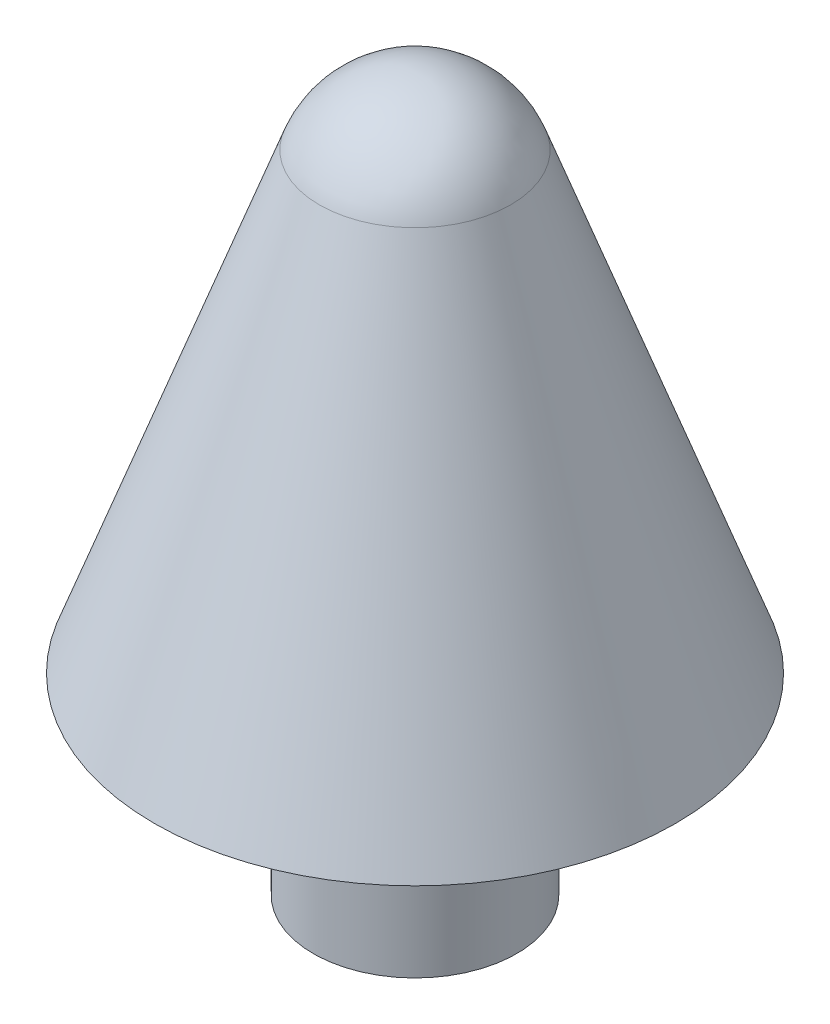
ISO-10303-21;
HEADER;
FILE_DESCRIPTION(('STEP AP214'),'2;1');
FILE_NAME('part.step','',(''),(''),'','','');
FILE_SCHEMA(('AUTOMOTIVE_DESIGN { 1 0 10303 214 1 1 1 1 }'));
ENDSEC;
DATA;
#1=APPLICATION_CONTEXT('core data for automotive mechanical design processes');
#2=APPLICATION_PROTOCOL_DEFINITION('international standard','automotive_design',2000,#1);
#3=PRODUCT_CONTEXT('',#1,'mechanical');
#4=PRODUCT('Part','Part','',(#3));
#5=PRODUCT_RELATED_PRODUCT_CATEGORY('part','',(#4));
#6=PRODUCT_DEFINITION_FORMATION('','',#4);
#7=PRODUCT_DEFINITION_CONTEXT('part definition',#1,'design');
#8=PRODUCT_DEFINITION('design','',#6,#7);
#9=PRODUCT_DEFINITION_SHAPE('','',#8);
#10=(LENGTH_UNIT() NAMED_UNIT(*) SI_UNIT(.MILLI.,.METRE.));
#11=(NAMED_UNIT(*) PLANE_ANGLE_UNIT() SI_UNIT($,.RADIAN.));
#12=(NAMED_UNIT(*) SI_UNIT($,.STERADIAN.) SOLID_ANGLE_UNIT());
#13=UNCERTAINTY_MEASURE_WITH_UNIT(LENGTH_MEASURE(1.E-05),#10,'distance_accuracy_value','');
#14=(GEOMETRIC_REPRESENTATION_CONTEXT(3) GLOBAL_UNCERTAINTY_ASSIGNED_CONTEXT((#13)) GLOBAL_UNIT_ASSIGNED_CONTEXT((#10,
#11,#12)) REPRESENTATION_CONTEXT('',''));
#15=CARTESIAN_POINT('',(0.,0.,0.));
#16=DIRECTION('',(0.,0.,1.));
#17=DIRECTION('',(1.,0.,0.));
#18=AXIS2_PLACEMENT_3D('',#15,#16,#17);
#19=CARTESIAN_POINT('',(0.,0.,0.));
#20=DIRECTION('',(0.,1.,0.));
#21=DIRECTION('',(-1.,0.,0.));
#22=AXIS2_PLACEMENT_3D('',#19,#20,#21);
#23=PLANE('',#22);
#24=CARTESIAN_POINT('',(0.,0.,0.));
#25=DIRECTION('',(0.,1.,0.));
#26=DIRECTION('',(-1.,0.,0.));
#27=AXIS2_PLACEMENT_3D('',#24,#25,#26);
#28=CIRCLE('',#27,3.175);
#29=CARTESIAN_POINT('',(-3.175,0.,0.));
#30=VERTEX_POINT('',#29);
#31=EDGE_CURVE('E10',#30,#30,#28,.T.);
#32=ORIENTED_EDGE('',*,*,#31,.F.);
#33=EDGE_LOOP('',(#32));
#34=FACE_BOUND('',#33,.T.);
#35=ADVANCED_FACE('F30',(#34),#23,.F.);
#36=CARTESIAN_POINT('',(0.,22.225,0.));
#37=DIRECTION('',(0.,1.,0.));
#38=DIRECTION('',(-1.,0.,0.));
#39=AXIS2_PLACEMENT_3D('',#36,#37,#38);
#40=CYLINDRICAL_SURFACE('',#39,3.175);
#41=CARTESIAN_POINT('',(0.,5.9944,0.));
#42=DIRECTION('',(0.,1.,0.));
#43=DIRECTION('',(-1.,0.,0.));
#44=AXIS2_PLACEMENT_3D('',#41,#42,#43);
#45=CIRCLE('',#44,3.175);
#46=CARTESIAN_POINT('',(-3.175,5.9944,0.));
#47=VERTEX_POINT('',#46);
#48=EDGE_CURVE('E36',#47,#47,#45,.T.);
#49=ORIENTED_EDGE('',*,*,#48,.F.);
#50=EDGE_LOOP('',(#49));
#51=FACE_BOUND('',#50,.T.);
#52=ORIENTED_EDGE('',*,*,#31,.T.);
#53=EDGE_LOOP('',(#52));
#54=FACE_BOUND('',#53,.T.);
#55=ADVANCED_FACE('F60',(#51,#54),#40,.T.);
#56=CARTESIAN_POINT('',(3.175,5.9944,0.));
#57=DIRECTION('',(0.,1.,0.));
#58=DIRECTION('',(-1.,0.,0.));
#59=AXIS2_PLACEMENT_3D('',#56,#57,#58);
#60=PLANE('',#59);
#61=CARTESIAN_POINT('',(0.,5.9944,0.));
#62=DIRECTION('',(0.,1.,0.));
#63=DIRECTION('',(-1.,0.,0.));
#64=AXIS2_PLACEMENT_3D('',#61,#62,#63);
#65=CIRCLE('',#64,8.13061421809692);
#66=CARTESIAN_POINT('',(-8.13061421809692,5.9944,0.));
#67=VERTEX_POINT('',#66);
#68=EDGE_CURVE('E40',#67,#67,#65,.T.);
#69=ORIENTED_EDGE('',*,*,#68,.F.);
#70=EDGE_LOOP('',(#69));
#71=FACE_BOUND('',#70,.T.);
#72=ORIENTED_EDGE('',*,*,#48,.T.);
#73=EDGE_LOOP('',(#72));
#74=FACE_BOUND('',#73,.T.);
#75=ADVANCED_FACE('F55',(#71,#74),#60,.F.);
#76=CARTESIAN_POINT('',(0.,5.9944,0.));
#77=DIRECTION('',(0.,-1.,0.));
#78=DIRECTION('',(1.,0.,0.));
#79=AXIS2_PLACEMENT_3D('',#76,#77,#78);
#80=CONICAL_SURFACE('',#79,8.13061421809692,0.34906585039887);
#81=CARTESIAN_POINT('',(0.,20.135913955059,0.));
#82=DIRECTION('',(0.,1.,0.));
#83=DIRECTION('',(-1.,0.,0.));
#84=AXIS2_PLACEMENT_3D('',#81,#82,#83);
#85=CIRCLE('',#84,2.98352407099525);
#86=CARTESIAN_POINT('',(-2.98352407099525,20.135913955059,0.));
#87=VERTEX_POINT('',#86);
#88=EDGE_CURVE('E44',#87,#87,#85,.T.);
#89=ORIENTED_EDGE('',*,*,#88,.F.);
#90=EDGE_LOOP('',(#89));
#91=FACE_BOUND('',#90,.T.);
#92=ORIENTED_EDGE('',*,*,#68,.T.);
#93=EDGE_LOOP('',(#92));
#94=FACE_BOUND('',#93,.T.);
#95=ADVANCED_FACE('F52',(#91,#94),#80,.T.);
#96=CARTESIAN_POINT('',(0.,19.05,0.));
#97=DIRECTION('',(0.,1.,0.));
#98=DIRECTION('',(1.,0.,0.));
#99=AXIS2_PLACEMENT_3D('',#96,#97,#98);
#100=SPHERICAL_SURFACE('',#99,3.175);
#101=ORIENTED_EDGE('',*,*,#88,.T.);
#102=EDGE_LOOP('',(#101));
#103=FACE_BOUND('',#102,.T.);
#104=ADVANCED_FACE('F50',(#103),#100,.T.);
#105=CLOSED_SHELL('',(#35,#55,#75,#95,#104));
#106=MANIFOLD_SOLID_BREP('B2',#105);
#107=ADVANCED_BREP_SHAPE_REPRESENTATION('',(#18,#106),#14);
#108=SHAPE_DEFINITION_REPRESENTATION(#9,#107);
ENDSEC;
END-ISO-10303-21;
